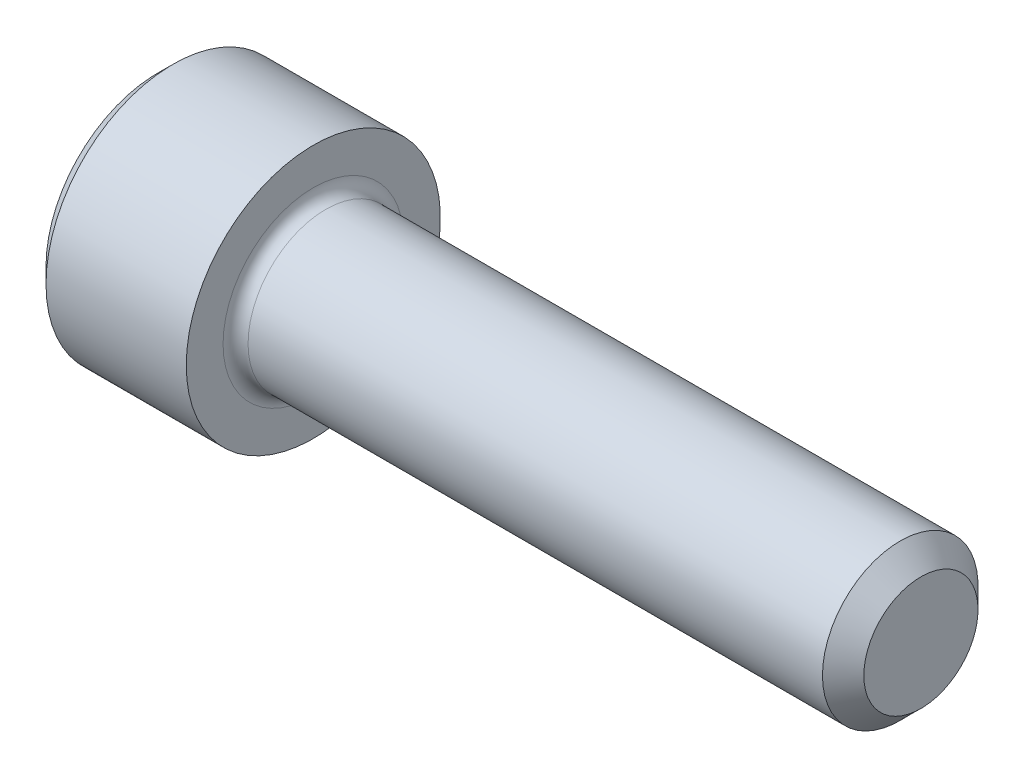
ISO-10303-21;
HEADER;
FILE_DESCRIPTION(('STEP AP214'),'2;1');
FILE_NAME('part.step','',(''),(''),'','','');
FILE_SCHEMA(('AUTOMOTIVE_DESIGN { 1 0 10303 214 1 1 1 1 }'));
ENDSEC;
DATA;
#1=APPLICATION_CONTEXT('core data for automotive mechanical design processes');
#2=APPLICATION_PROTOCOL_DEFINITION('international standard','automotive_design',2000,#1);
#3=PRODUCT_CONTEXT('',#1,'mechanical');
#4=PRODUCT('Part','Part','',(#3));
#5=PRODUCT_RELATED_PRODUCT_CATEGORY('part','',(#4));
#6=PRODUCT_DEFINITION_FORMATION('','',#4);
#7=PRODUCT_DEFINITION_CONTEXT('part definition',#1,'design');
#8=PRODUCT_DEFINITION('design','',#6,#7);
#9=PRODUCT_DEFINITION_SHAPE('','',#8);
#10=(LENGTH_UNIT() NAMED_UNIT(*) SI_UNIT(.MILLI.,.METRE.));
#11=(NAMED_UNIT(*) PLANE_ANGLE_UNIT() SI_UNIT($,.RADIAN.));
#12=(NAMED_UNIT(*) SI_UNIT($,.STERADIAN.) SOLID_ANGLE_UNIT());
#13=UNCERTAINTY_MEASURE_WITH_UNIT(LENGTH_MEASURE(1.E-05),#10,'distance_accuracy_value','');
#14=(GEOMETRIC_REPRESENTATION_CONTEXT(3) GLOBAL_UNCERTAINTY_ASSIGNED_CONTEXT((#13)) GLOBAL_UNIT_ASSIGNED_CONTEXT((#10,
#11,#12)) REPRESENTATION_CONTEXT('',''));
#15=CARTESIAN_POINT('',(0.,0.,0.));
#16=DIRECTION('',(0.,0.,1.));
#17=DIRECTION('',(1.,0.,0.));
#18=AXIS2_PLACEMENT_3D('',#15,#16,#17);
#19=CARTESIAN_POINT('',(0.,0.,0.));
#20=DIRECTION('',(-1.,0.,0.));
#21=DIRECTION('',(0.,0.,1.));
#22=AXIS2_PLACEMENT_3D('',#19,#20,#21);
#23=PLANE('',#22);
#24=DIRECTION('',(0.,-0.499999999999998,0.86602540378444));
#25=VECTOR('',#24,1.);
#26=CARTESIAN_POINT('',(0.,1.37848150271715,0.));
#27=LINE('',#26,#25);
#28=CARTESIAN_POINT('',(0.,1.37848150271715,0.));
#29=VERTEX_POINT('',#28);
#30=CARTESIAN_POINT('',(0.,0.689240751358583,1.1938));
#31=VERTEX_POINT('',#30);
#32=EDGE_CURVE('E262',#29,#31,#27,.T.);
#33=ORIENTED_EDGE('',*,*,#32,.T.);
#34=DIRECTION('',(0.,1.,0.));
#35=VECTOR('',#34,1.);
#36=CARTESIAN_POINT('',(0.,-0.689240751358568,1.1938));
#37=LINE('',#36,#35);
#38=CARTESIAN_POINT('',(0.,-0.689240751358568,1.1938));
#39=VERTEX_POINT('',#38);
#40=EDGE_CURVE('E133',#39,#31,#37,.T.);
#41=ORIENTED_EDGE('',*,*,#40,.F.);
#42=DIRECTION('',(0.,-0.500000000000001,-0.866025403784438));
#43=VECTOR('',#42,1.);
#44=CARTESIAN_POINT('',(0.,-0.689240751358568,1.1938));
#45=LINE('',#44,#43);
#46=CARTESIAN_POINT('',(0.,-1.37848150271714,0.));
#47=VERTEX_POINT('',#46);
#48=EDGE_CURVE('E265',#39,#47,#45,.T.);
#49=ORIENTED_EDGE('',*,*,#48,.T.);
#50=DIRECTION('',(0.,0.499999999999998,-0.86602540378444));
#51=VECTOR('',#50,1.);
#52=CARTESIAN_POINT('',(0.,-1.37848150271714,0.));
#53=LINE('',#52,#51);
#54=CARTESIAN_POINT('',(0.,-0.689240751358572,-1.1938));
#55=VERTEX_POINT('',#54);
#56=EDGE_CURVE('E268',#47,#55,#53,.T.);
#57=ORIENTED_EDGE('',*,*,#56,.T.);
#58=DIRECTION('',(0.,-1.,0.));
#59=VECTOR('',#58,1.);
#60=CARTESIAN_POINT('',(0.,0.689240751358578,-1.1938));
#61=LINE('',#60,#59);
#62=CARTESIAN_POINT('',(0.,0.689240751358578,-1.1938));
#63=VERTEX_POINT('',#62);
#64=EDGE_CURVE('E271',#63,#55,#61,.T.);
#65=ORIENTED_EDGE('',*,*,#64,.F.);
#66=DIRECTION('',(0.,-0.500000000000001,-0.866025403784438));
#67=VECTOR('',#66,1.);
#68=CARTESIAN_POINT('',(0.,1.37848150271715,0.));
#69=LINE('',#68,#67);
#70=EDGE_CURVE('E128',#29,#63,#69,.T.);
#71=ORIENTED_EDGE('',*,*,#70,.F.);
#72=EDGE_LOOP('',(#33,#41,#49,#57,#65,#71));
#73=FACE_BOUND('',#72,.T.);
#74=CARTESIAN_POINT('',(0.,0.,0.));
#75=DIRECTION('',(-1.,0.,0.));
#76=DIRECTION('',(0.,0.,1.));
#77=AXIS2_PLACEMENT_3D('',#74,#75,#76);
#78=CIRCLE('',#77,2.0447);
#79=CARTESIAN_POINT('',(0.,0.,2.0447));
#80=VERTEX_POINT('',#79);
#81=EDGE_CURVE('E157',#80,#80,#78,.T.);
#82=ORIENTED_EDGE('',*,*,#81,.T.);
#83=EDGE_LOOP('',(#82));
#84=FACE_BOUND('',#83,.T.);
#85=ADVANCED_FACE('F37',(#73,#84),#23,.T.);
#86=CARTESIAN_POINT('',(0.,0.,0.));
#87=DIRECTION('',(1.,0.,0.));
#88=DIRECTION('',(0.,0.,-1.));
#89=AXIS2_PLACEMENT_3D('',#86,#87,#88);
#90=CONICAL_SURFACE('',#89,2.0447,0.785398163397449);
#91=CARTESIAN_POINT('',(0.279399999999999,0.,0.));
#92=DIRECTION('',(-1.,0.,0.));
#93=DIRECTION('',(0.,0.,1.));
#94=AXIS2_PLACEMENT_3D('',#91,#92,#93);
#95=CIRCLE('',#94,2.3241);
#96=CARTESIAN_POINT('',(0.279399999999999,0.,2.3241));
#97=VERTEX_POINT('',#96);
#98=EDGE_CURVE('E154',#97,#97,#95,.T.);
#99=ORIENTED_EDGE('',*,*,#98,.T.);
#100=EDGE_LOOP('',(#99));
#101=FACE_BOUND('',#100,.T.);
#102=ORIENTED_EDGE('',*,*,#81,.F.);
#103=EDGE_LOOP('',(#102));
#104=FACE_BOUND('',#103,.T.);
#105=ADVANCED_FACE('F178',(#101,#104),#90,.T.);
#106=CARTESIAN_POINT('',(-31.75,0.,0.));
#107=DIRECTION('',(-1.,0.,0.));
#108=DIRECTION('',(0.,0.,1.));
#109=AXIS2_PLACEMENT_3D('',#106,#107,#108);
#110=CYLINDRICAL_SURFACE('',#109,2.3241);
#111=CARTESIAN_POINT('',(2.8448,0.,0.));
#112=DIRECTION('',(-1.,0.,0.));
#113=DIRECTION('',(0.,0.,1.));
#114=AXIS2_PLACEMENT_3D('',#111,#112,#113);
#115=CIRCLE('',#114,2.3241);
#116=CARTESIAN_POINT('',(2.8448,0.,2.3241));
#117=VERTEX_POINT('',#116);
#118=EDGE_CURVE('E151',#117,#117,#115,.T.);
#119=ORIENTED_EDGE('',*,*,#118,.T.);
#120=EDGE_LOOP('',(#119));
#121=FACE_BOUND('',#120,.T.);
#122=ORIENTED_EDGE('',*,*,#98,.F.);
#123=EDGE_LOOP('',(#122));
#124=FACE_BOUND('',#123,.T.);
#125=ADVANCED_FACE('F183',(#121,#124),#110,.T.);
#126=CARTESIAN_POINT('',(2.8448,2.3241,0.));
#127=DIRECTION('',(1.,0.,0.));
#128=DIRECTION('',(0.,0.,-1.));
#129=AXIS2_PLACEMENT_3D('',#126,#127,#128);
#130=PLANE('',#129);
#131=CARTESIAN_POINT('',(2.8448,0.,0.));
#132=DIRECTION('',(1.,0.,0.));
#133=DIRECTION('',(0.,0.,-1.));
#134=AXIS2_PLACEMENT_3D('',#131,#132,#133);
#135=CIRCLE('',#134,1.651);
#136=CARTESIAN_POINT('',(2.8448,0.,-1.651));
#137=VERTEX_POINT('',#136);
#138=EDGE_CURVE('E45',#137,#137,#135,.F.);
#139=ORIENTED_EDGE('',*,*,#138,.T.);
#140=EDGE_LOOP('',(#139));
#141=FACE_BOUND('',#140,.T.);
#142=ORIENTED_EDGE('',*,*,#118,.F.);
#143=EDGE_LOOP('',(#142));
#144=FACE_BOUND('',#143,.T.);
#145=ADVANCED_FACE('F162',(#141,#144),#130,.T.);
#146=CARTESIAN_POINT('',(-31.75,0.,0.));
#147=DIRECTION('',(-1.,0.,0.));
#148=DIRECTION('',(0.,0.,1.));
#149=AXIS2_PLACEMENT_3D('',#146,#147,#148);
#150=CYLINDRICAL_SURFACE('',#149,1.4224);
#151=CARTESIAN_POINT('',(3.0734,0.,0.));
#152=DIRECTION('',(1.,0.,0.));
#153=DIRECTION('',(0.,0.,-1.));
#154=AXIS2_PLACEMENT_3D('',#151,#152,#153);
#155=CIRCLE('',#154,1.4224);
#156=CARTESIAN_POINT('',(3.0734,0.,-1.4224));
#157=VERTEX_POINT('',#156);
#158=EDGE_CURVE('E11',#157,#157,#155,.T.);
#159=ORIENTED_EDGE('',*,*,#158,.T.);
#160=EDGE_LOOP('',(#159));
#161=FACE_BOUND('',#160,.T.);
#162=CARTESIAN_POINT('',(13.57884,0.,0.));
#163=DIRECTION('',(-1.,0.,0.));
#164=DIRECTION('',(0.,0.,1.));
#165=AXIS2_PLACEMENT_3D('',#162,#163,#164);
#166=CIRCLE('',#165,1.4224);
#167=CARTESIAN_POINT('',(13.57884,0.,1.4224));
#168=VERTEX_POINT('',#167);
#169=EDGE_CURVE('E148',#168,#168,#166,.T.);
#170=ORIENTED_EDGE('',*,*,#169,.T.);
#171=EDGE_LOOP('',(#170));
#172=FACE_BOUND('',#171,.T.);
#173=ADVANCED_FACE('F193',(#161,#172),#150,.T.);
#174=CARTESIAN_POINT('',(13.9573,0.,0.));
#175=DIRECTION('',(-1.,0.,0.));
#176=DIRECTION('',(0.,0.,1.));
#177=AXIS2_PLACEMENT_3D('',#174,#175,#176);
#178=CONICAL_SURFACE('',#177,1.04394,0.785398163397452);
#179=ORIENTED_EDGE('',*,*,#169,.F.);
#180=EDGE_LOOP('',(#179));
#181=FACE_BOUND('',#180,.T.);
#182=CARTESIAN_POINT('',(13.9573,0.,0.));
#183=DIRECTION('',(-1.,0.,0.));
#184=DIRECTION('',(0.,0.,1.));
#185=AXIS2_PLACEMENT_3D('',#182,#183,#184);
#186=CIRCLE('',#185,1.04394);
#187=CARTESIAN_POINT('',(13.9573,0.,1.04394));
#188=VERTEX_POINT('',#187);
#189=EDGE_CURVE('E144',#188,#188,#186,.T.);
#190=ORIENTED_EDGE('',*,*,#189,.T.);
#191=EDGE_LOOP('',(#190));
#192=FACE_BOUND('',#191,.T.);
#193=ADVANCED_FACE('F173',(#181,#192),#178,.T.);
#194=CARTESIAN_POINT('',(13.9573,1.04394,0.));
#195=DIRECTION('',(1.,0.,0.));
#196=DIRECTION('',(0.,0.,-1.));
#197=AXIS2_PLACEMENT_3D('',#194,#195,#196);
#198=PLANE('',#197);
#199=ORIENTED_EDGE('',*,*,#189,.F.);
#200=EDGE_LOOP('',(#199));
#201=FACE_BOUND('',#200,.T.);
#202=ADVANCED_FACE('F166',(#201),#198,.T.);
#203=CARTESIAN_POINT('',(3.0734,0.,0.));
#204=DIRECTION('',(1.,0.,0.));
#205=DIRECTION('',(0.,0.,-1.));
#206=AXIS2_PLACEMENT_3D('',#203,#204,#205);
#207=TOROIDAL_SURFACE('',#206,1.651,0.2286);
#208=ORIENTED_EDGE('',*,*,#158,.F.);
#209=EDGE_LOOP('',(#208));
#210=FACE_BOUND('',#209,.T.);
#211=ORIENTED_EDGE('',*,*,#138,.F.);
#212=EDGE_LOOP('',(#211));
#213=FACE_BOUND('',#212,.T.);
#214=ADVANCED_FACE('F39',(#210,#213),#207,.F.);
#215=CARTESIAN_POINT('',(1.2954,1.37848150271715,0.));
#216=DIRECTION('',(0.,-0.86602540378444,-0.499999999999998));
#217=DIRECTION('',(0.,0.499999999999998,-0.86602540378444));
#218=AXIS2_PLACEMENT_3D('',#215,#216,#217);
#219=PLANE('',#218);
#220=ORIENTED_EDGE('',*,*,#32,.F.);
#221=DIRECTION('',(-1.,0.,0.));
#222=VECTOR('',#221,1.);
#223=CARTESIAN_POINT('',(1.2954,1.37848150271715,0.));
#224=LINE('',#223,#222);
#225=CARTESIAN_POINT('',(1.2954,1.37848150271715,0.));
#226=VERTEX_POINT('',#225);
#227=EDGE_CURVE('E252',#226,#29,#224,.T.);
#228=ORIENTED_EDGE('',*,*,#227,.F.);
#229=DIRECTION('',(0.,-0.499999999999998,0.86602540378444));
#230=VECTOR('',#229,1.);
#231=CARTESIAN_POINT('',(1.2954,1.37848150271715,0.));
#232=LINE('',#231,#230);
#233=CARTESIAN_POINT('',(1.2954,1.03386112703787,0.596899999999999));
#234=VERTEX_POINT('',#233);
#235=EDGE_CURVE('E120',#226,#234,#232,.T.);
#236=ORIENTED_EDGE('',*,*,#235,.T.);
#237=CARTESIAN_POINT('',(1.2954,0.689240751358583,1.1938));
#238=VERTEX_POINT('',#237);
#239=EDGE_CURVE('E111',#234,#238,#232,.T.);
#240=ORIENTED_EDGE('',*,*,#239,.T.);
#241=DIRECTION('',(-1.,0.,0.));
#242=VECTOR('',#241,1.);
#243=CARTESIAN_POINT('',(1.2954,0.689240751358583,1.1938));
#244=LINE('',#243,#242);
#245=EDGE_CURVE('E125',#238,#31,#244,.T.);
#246=ORIENTED_EDGE('',*,*,#245,.T.);
#247=EDGE_LOOP('',(#220,#228,#236,#240,#246));
#248=FACE_BOUND('',#247,.T.);
#249=ADVANCED_FACE('F124',(#248),#219,.T.);
#250=CARTESIAN_POINT('',(1.2954,-0.689240751358568,1.1938));
#251=DIRECTION('',(0.,0.,1.));
#252=DIRECTION('',(0.,-1.,0.));
#253=AXIS2_PLACEMENT_3D('',#250,#251,#252);
#254=PLANE('',#253);
#255=ORIENTED_EDGE('',*,*,#40,.T.);
#256=ORIENTED_EDGE('',*,*,#245,.F.);
#257=DIRECTION('',(0.,1.,0.));
#258=VECTOR('',#257,1.);
#259=CARTESIAN_POINT('',(1.2954,-0.689240751358568,1.1938));
#260=LINE('',#259,#258);
#261=CARTESIAN_POINT('',(1.2954,0.,1.1938));
#262=VERTEX_POINT('',#261);
#263=EDGE_CURVE('E108',#262,#238,#260,.T.);
#264=ORIENTED_EDGE('',*,*,#263,.F.);
#265=CARTESIAN_POINT('',(1.2954,-0.689240751358568,1.1938));
#266=VERTEX_POINT('',#265);
#267=EDGE_CURVE('E119',#266,#262,#260,.T.);
#268=ORIENTED_EDGE('',*,*,#267,.F.);
#269=DIRECTION('',(-1.,0.,0.));
#270=VECTOR('',#269,1.);
#271=CARTESIAN_POINT('',(1.2954,-0.689240751358568,1.1938));
#272=LINE('',#271,#270);
#273=EDGE_CURVE('E135',#266,#39,#272,.T.);
#274=ORIENTED_EDGE('',*,*,#273,.T.);
#275=EDGE_LOOP('',(#255,#256,#264,#268,#274));
#276=FACE_BOUND('',#275,.T.);
#277=ADVANCED_FACE('F130',(#276),#254,.F.);
#278=CARTESIAN_POINT('',(1.2954,-0.689240751358568,1.1938));
#279=DIRECTION('',(0.,0.866025403784438,-0.500000000000001));
#280=DIRECTION('',(0.,0.500000000000001,0.866025403784438));
#281=AXIS2_PLACEMENT_3D('',#278,#279,#280);
#282=PLANE('',#281);
#283=ORIENTED_EDGE('',*,*,#48,.F.);
#284=ORIENTED_EDGE('',*,*,#273,.F.);
#285=DIRECTION('',(0.,-0.500000000000001,-0.866025403784438));
#286=VECTOR('',#285,1.);
#287=CARTESIAN_POINT('',(1.2954,-0.689240751358568,1.1938));
#288=LINE('',#287,#286);
#289=CARTESIAN_POINT('',(1.2954,-1.03386112703786,0.596899999999998));
#290=VERTEX_POINT('',#289);
#291=EDGE_CURVE('E291',#266,#290,#288,.T.);
#292=ORIENTED_EDGE('',*,*,#291,.T.);
#293=CARTESIAN_POINT('',(1.2954,-1.37848150271714,0.));
#294=VERTEX_POINT('',#293);
#295=EDGE_CURVE('E280',#290,#294,#288,.T.);
#296=ORIENTED_EDGE('',*,*,#295,.T.);
#297=DIRECTION('',(-1.,0.,0.));
#298=VECTOR('',#297,1.);
#299=CARTESIAN_POINT('',(1.2954,-1.37848150271714,0.));
#300=LINE('',#299,#298);
#301=EDGE_CURVE('E140',#294,#47,#300,.T.);
#302=ORIENTED_EDGE('',*,*,#301,.T.);
#303=EDGE_LOOP('',(#283,#284,#292,#296,#302));
#304=FACE_BOUND('',#303,.T.);
#305=ADVANCED_FACE('F206',(#304),#282,.T.);
#306=CARTESIAN_POINT('',(1.2954,-1.37848150271714,0.));
#307=DIRECTION('',(0.,0.86602540378444,0.499999999999998));
#308=DIRECTION('',(0.,-0.499999999999998,0.86602540378444));
#309=AXIS2_PLACEMENT_3D('',#306,#307,#308);
#310=PLANE('',#309);
#311=ORIENTED_EDGE('',*,*,#56,.F.);
#312=ORIENTED_EDGE('',*,*,#301,.F.);
#313=DIRECTION('',(0.,0.499999999999998,-0.86602540378444));
#314=VECTOR('',#313,1.);
#315=CARTESIAN_POINT('',(1.2954,-1.37848150271714,0.));
#316=LINE('',#315,#314);
#317=CARTESIAN_POINT('',(1.2954,-1.03386112703786,-0.596899999999996));
#318=VERTEX_POINT('',#317);
#319=EDGE_CURVE('E258',#294,#318,#316,.T.);
#320=ORIENTED_EDGE('',*,*,#319,.T.);
#321=CARTESIAN_POINT('',(1.2954,-0.689240751358572,-1.1938));
#322=VERTEX_POINT('',#321);
#323=EDGE_CURVE('E290',#318,#322,#316,.T.);
#324=ORIENTED_EDGE('',*,*,#323,.T.);
#325=DIRECTION('',(-1.,0.,0.));
#326=VECTOR('',#325,1.);
#327=CARTESIAN_POINT('',(1.2954,-0.689240751358572,-1.1938));
#328=LINE('',#327,#326);
#329=EDGE_CURVE('E251',#322,#55,#328,.T.);
#330=ORIENTED_EDGE('',*,*,#329,.T.);
#331=EDGE_LOOP('',(#311,#312,#320,#324,#330));
#332=FACE_BOUND('',#331,.T.);
#333=ADVANCED_FACE('F209',(#332),#310,.T.);
#334=CARTESIAN_POINT('',(1.2954,0.689240751358578,-1.1938));
#335=DIRECTION('',(0.,0.,-1.));
#336=DIRECTION('',(0.,1.,0.));
#337=AXIS2_PLACEMENT_3D('',#334,#335,#336);
#338=PLANE('',#337);
#339=ORIENTED_EDGE('',*,*,#64,.T.);
#340=ORIENTED_EDGE('',*,*,#329,.F.);
#341=DIRECTION('',(0.,-1.,0.));
#342=VECTOR('',#341,1.);
#343=CARTESIAN_POINT('',(1.2954,0.689240751358578,-1.1938));
#344=LINE('',#343,#342);
#345=CARTESIAN_POINT('',(1.2954,0.,-1.1938));
#346=VERTEX_POINT('',#345);
#347=EDGE_CURVE('E255',#346,#322,#344,.T.);
#348=ORIENTED_EDGE('',*,*,#347,.F.);
#349=CARTESIAN_POINT('',(1.2954,0.689240751358578,-1.1938));
#350=VERTEX_POINT('',#349);
#351=EDGE_CURVE('E52',#350,#346,#344,.T.);
#352=ORIENTED_EDGE('',*,*,#351,.F.);
#353=DIRECTION('',(-1.,0.,0.));
#354=VECTOR('',#353,1.);
#355=CARTESIAN_POINT('',(1.2954,0.689240751358578,-1.1938));
#356=LINE('',#355,#354);
#357=EDGE_CURVE('E248',#350,#63,#356,.T.);
#358=ORIENTED_EDGE('',*,*,#357,.T.);
#359=EDGE_LOOP('',(#339,#340,#348,#352,#358));
#360=FACE_BOUND('',#359,.T.);
#361=ADVANCED_FACE('F213',(#360),#338,.F.);
#362=CARTESIAN_POINT('',(1.2954,1.37848150271715,0.));
#363=DIRECTION('',(0.,0.866025403784438,-0.500000000000001));
#364=DIRECTION('',(0.,0.500000000000001,0.866025403784438));
#365=AXIS2_PLACEMENT_3D('',#362,#363,#364);
#366=PLANE('',#365);
#367=ORIENTED_EDGE('',*,*,#70,.T.);
#368=ORIENTED_EDGE('',*,*,#357,.F.);
#369=DIRECTION('',(0.,-0.500000000000001,-0.866025403784438));
#370=VECTOR('',#369,1.);
#371=CARTESIAN_POINT('',(1.2954,1.37848150271715,0.));
#372=LINE('',#371,#370);
#373=CARTESIAN_POINT('',(1.2954,1.03386112703787,-0.596900000000004));
#374=VERTEX_POINT('',#373);
#375=EDGE_CURVE('E238',#374,#350,#372,.T.);
#376=ORIENTED_EDGE('',*,*,#375,.F.);
#377=EDGE_CURVE('E244',#226,#374,#372,.T.);
#378=ORIENTED_EDGE('',*,*,#377,.F.);
#379=ORIENTED_EDGE('',*,*,#227,.T.);
#380=EDGE_LOOP('',(#367,#368,#376,#378,#379));
#381=FACE_BOUND('',#380,.T.);
#382=ADVANCED_FACE('F217',(#381),#366,.F.);
#383=CARTESIAN_POINT('',(1.2954,2.06772225407573,-1.1938));
#384=DIRECTION('',(1.,0.,0.));
#385=DIRECTION('',(0.,0.,-1.));
#386=AXIS2_PLACEMENT_3D('',#383,#384,#385);
#387=PLANE('',#386);
#388=ORIENTED_EDGE('',*,*,#347,.T.);
#389=ORIENTED_EDGE('',*,*,#323,.F.);
#390=CARTESIAN_POINT('',(1.2954,0.,0.));
#391=DIRECTION('',(-1.,0.,0.));
#392=DIRECTION('',(0.,0.,1.));
#393=AXIS2_PLACEMENT_3D('',#390,#391,#392);
#394=CIRCLE('',#393,1.1938);
#395=EDGE_CURVE('E286',#346,#318,#394,.T.);
#396=ORIENTED_EDGE('',*,*,#395,.F.);
#397=EDGE_LOOP('',(#388,#389,#396));
#398=FACE_BOUND('',#397,.T.);
#399=ADVANCED_FACE('F221',(#398),#387,.F.);
#400=ORIENTED_EDGE('',*,*,#319,.F.);
#401=ORIENTED_EDGE('',*,*,#295,.F.);
#402=EDGE_CURVE('E138',#318,#290,#394,.T.);
#403=ORIENTED_EDGE('',*,*,#402,.F.);
#404=EDGE_LOOP('',(#400,#401,#403));
#405=FACE_BOUND('',#404,.T.);
#406=ADVANCED_FACE('F224',(#405),#387,.F.);
#407=ORIENTED_EDGE('',*,*,#291,.F.);
#408=ORIENTED_EDGE('',*,*,#267,.T.);
#409=EDGE_CURVE('E134',#290,#262,#394,.T.);
#410=ORIENTED_EDGE('',*,*,#409,.F.);
#411=EDGE_LOOP('',(#407,#408,#410));
#412=FACE_BOUND('',#411,.T.);
#413=ADVANCED_FACE('F229',(#412),#387,.F.);
#414=ORIENTED_EDGE('',*,*,#263,.T.);
#415=ORIENTED_EDGE('',*,*,#239,.F.);
#416=EDGE_CURVE('E114',#262,#234,#394,.T.);
#417=ORIENTED_EDGE('',*,*,#416,.F.);
#418=EDGE_LOOP('',(#414,#415,#417));
#419=FACE_BOUND('',#418,.T.);
#420=ADVANCED_FACE('F110',(#419),#387,.F.);
#421=ORIENTED_EDGE('',*,*,#235,.F.);
#422=ORIENTED_EDGE('',*,*,#377,.T.);
#423=EDGE_CURVE('E145',#234,#374,#394,.T.);
#424=ORIENTED_EDGE('',*,*,#423,.F.);
#425=EDGE_LOOP('',(#421,#422,#424));
#426=FACE_BOUND('',#425,.T.);
#427=ADVANCED_FACE('F232',(#426),#387,.F.);
#428=ORIENTED_EDGE('',*,*,#375,.T.);
#429=ORIENTED_EDGE('',*,*,#351,.T.);
#430=EDGE_CURVE('E241',#374,#346,#394,.T.);
#431=ORIENTED_EDGE('',*,*,#430,.F.);
#432=EDGE_LOOP('',(#428,#429,#431));
#433=FACE_BOUND('',#432,.T.);
#434=ADVANCED_FACE('F202',(#433),#387,.F.);
#435=CARTESIAN_POINT('',(1.2954,0.,0.));
#436=DIRECTION('',(-1.,0.,0.));
#437=DIRECTION('',(0.,0.,1.));
#438=AXIS2_PLACEMENT_3D('',#435,#436,#437);
#439=CONICAL_SURFACE('',#438,1.1938,1.04719755119659);
#440=CARTESIAN_POINT('',(1.98464075135859,0.,0.));
#441=VERTEX_POINT('',#440);
#442=VERTEX_LOOP('',#441);
#443=FACE_BOUND('',#442,.T.);
#444=ORIENTED_EDGE('',*,*,#416,.T.);
#445=ORIENTED_EDGE('',*,*,#423,.T.);
#446=ORIENTED_EDGE('',*,*,#430,.T.);
#447=ORIENTED_EDGE('',*,*,#395,.T.);
#448=ORIENTED_EDGE('',*,*,#402,.T.);
#449=ORIENTED_EDGE('',*,*,#409,.T.);
#450=EDGE_LOOP('',(#444,#445,#446,#447,#448,#449));
#451=FACE_BOUND('',#450,.T.);
#452=ADVANCED_FACE('F200',(#443,#451),#439,.F.);
#453=CLOSED_SHELL('',(#85,#105,#125,#145,#173,#193,#202,#214,#249,#277,#305,#333,#361,#382,#399,
#406,#413,#420,#427,#434,#452));
#454=MANIFOLD_SOLID_BREP('B2',#453);
#455=ADVANCED_BREP_SHAPE_REPRESENTATION('',(#18,#454),#14);
#456=SHAPE_DEFINITION_REPRESENTATION(#9,#455);
ENDSEC;
END-ISO-10303-21;
